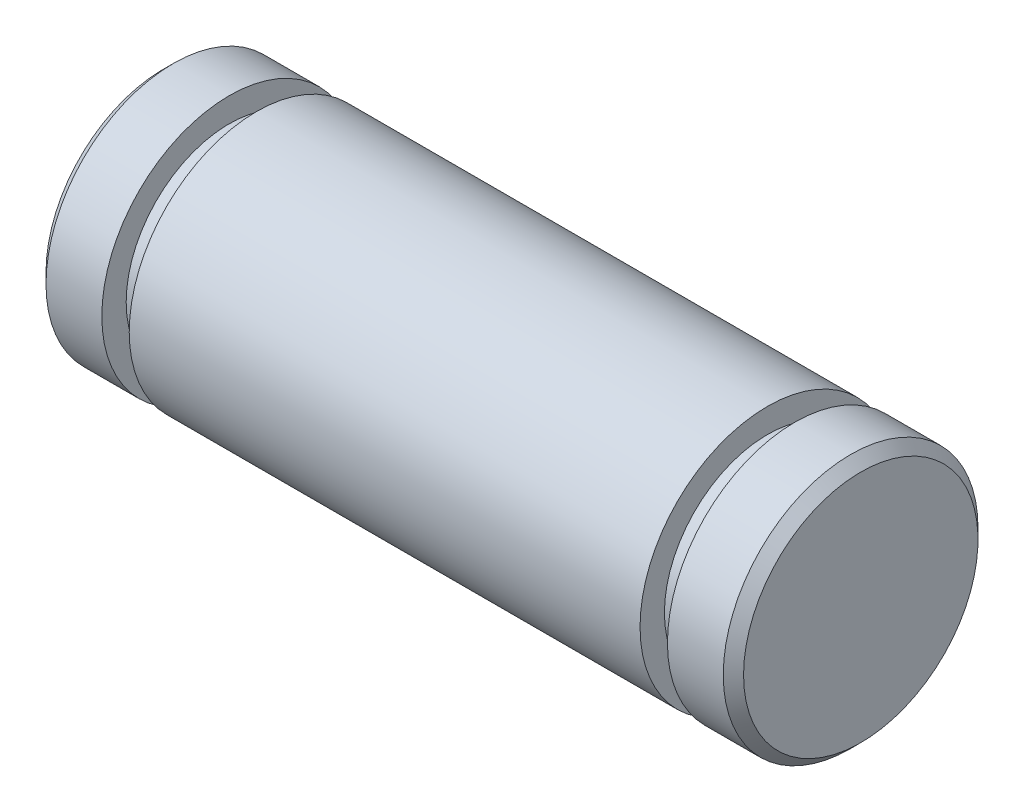
ISO-10303-21;
HEADER;
FILE_DESCRIPTION(('STEP AP214'),'2;1');
FILE_NAME('part.step','',(''),(''),'','','');
FILE_SCHEMA(('AUTOMOTIVE_DESIGN { 1 0 10303 214 1 1 1 1 }'));
ENDSEC;
DATA;
#1=APPLICATION_CONTEXT('core data for automotive mechanical design processes');
#2=APPLICATION_PROTOCOL_DEFINITION('international standard','automotive_design',2000,#1);
#3=PRODUCT_CONTEXT('',#1,'mechanical');
#4=PRODUCT('Part','Part','',(#3));
#5=PRODUCT_RELATED_PRODUCT_CATEGORY('part','',(#4));
#6=PRODUCT_DEFINITION_FORMATION('','',#4);
#7=PRODUCT_DEFINITION_CONTEXT('part definition',#1,'design');
#8=PRODUCT_DEFINITION('design','',#6,#7);
#9=PRODUCT_DEFINITION_SHAPE('','',#8);
#10=(LENGTH_UNIT() NAMED_UNIT(*) SI_UNIT(.MILLI.,.METRE.));
#11=(NAMED_UNIT(*) PLANE_ANGLE_UNIT() SI_UNIT($,.RADIAN.));
#12=(NAMED_UNIT(*) SI_UNIT($,.STERADIAN.) SOLID_ANGLE_UNIT());
#13=UNCERTAINTY_MEASURE_WITH_UNIT(LENGTH_MEASURE(1.E-05),#10,'distance_accuracy_value','');
#14=(GEOMETRIC_REPRESENTATION_CONTEXT(3) GLOBAL_UNCERTAINTY_ASSIGNED_CONTEXT((#13)) GLOBAL_UNIT_ASSIGNED_CONTEXT((#10,
#11,#12)) REPRESENTATION_CONTEXT('',''));
#15=CARTESIAN_POINT('',(0.,0.,0.));
#16=DIRECTION('',(0.,0.,1.));
#17=DIRECTION('',(1.,0.,0.));
#18=AXIS2_PLACEMENT_3D('',#15,#16,#17);
#19=CARTESIAN_POINT('',(-13.0937,0.,0.));
#20=DIRECTION('',(1.,0.,0.));
#21=DIRECTION('',(0.,0.,-1.));
#22=AXIS2_PLACEMENT_3D('',#19,#20,#21);
#23=PLANE('',#22);
#24=CARTESIAN_POINT('',(-13.0937,0.,0.));
#25=DIRECTION('',(-1.,0.,0.));
#26=DIRECTION('',(0.,0.,1.));
#27=AXIS2_PLACEMENT_3D('',#24,#25,#26);
#28=CIRCLE('',#27,4.40055);
#29=CARTESIAN_POINT('',(-13.0937,0.,4.40055));
#30=VERTEX_POINT('',#29);
#31=EDGE_CURVE('E10',#30,#30,#28,.T.);
#32=ORIENTED_EDGE('',*,*,#31,.T.);
#33=EDGE_LOOP('',(#32));
#34=FACE_BOUND('',#33,.T.);
#35=ADVANCED_FACE('F36',(#34),#23,.F.);
#36=CARTESIAN_POINT('',(-12.7127,0.,0.));
#37=DIRECTION('',(1.,0.,0.));
#38=DIRECTION('',(0.,0.,-1.));
#39=AXIS2_PLACEMENT_3D('',#36,#37,#38);
#40=CONICAL_SURFACE('',#39,4.78155,0.785398163397448);
#41=ORIENTED_EDGE('',*,*,#31,.F.);
#42=EDGE_LOOP('',(#41));
#43=FACE_BOUND('',#42,.T.);
#44=CARTESIAN_POINT('',(-12.7127,0.,0.));
#45=DIRECTION('',(-1.,0.,0.));
#46=DIRECTION('',(0.,0.,1.));
#47=AXIS2_PLACEMENT_3D('',#44,#45,#46);
#48=CIRCLE('',#47,4.78155);
#49=CARTESIAN_POINT('',(-12.7127,0.,4.78155));
#50=VERTEX_POINT('',#49);
#51=EDGE_CURVE('E42',#50,#50,#48,.T.);
#52=ORIENTED_EDGE('',*,*,#51,.T.);
#53=EDGE_LOOP('',(#52));
#54=FACE_BOUND('',#53,.T.);
#55=ADVANCED_FACE('F92',(#43,#54),#40,.T.);
#56=CARTESIAN_POINT('',(13.0937,0.,0.));
#57=DIRECTION('',(-1.,0.,0.));
#58=DIRECTION('',(0.,0.,1.));
#59=AXIS2_PLACEMENT_3D('',#56,#57,#58);
#60=CYLINDRICAL_SURFACE('',#59,4.78155);
#61=ORIENTED_EDGE('',*,*,#51,.F.);
#62=EDGE_LOOP('',(#61));
#63=FACE_BOUND('',#62,.T.);
#64=CARTESIAN_POINT('',(-10.6172,0.,0.));
#65=DIRECTION('',(-1.,0.,0.));
#66=DIRECTION('',(0.,0.,1.));
#67=AXIS2_PLACEMENT_3D('',#64,#65,#66);
#68=CIRCLE('',#67,4.78155);
#69=CARTESIAN_POINT('',(-10.6172,0.,4.78155));
#70=VERTEX_POINT('',#69);
#71=EDGE_CURVE('E46',#70,#70,#68,.T.);
#72=ORIENTED_EDGE('',*,*,#71,.T.);
#73=EDGE_LOOP('',(#72));
#74=FACE_BOUND('',#73,.T.);
#75=ADVANCED_FACE('F96',(#63,#74),#60,.T.);
#76=CARTESIAN_POINT('',(-10.6172,4.78155,0.));
#77=DIRECTION('',(-1.,0.,0.));
#78=DIRECTION('',(0.,0.,1.));
#79=AXIS2_PLACEMENT_3D('',#76,#77,#78);
#80=PLANE('',#79);
#81=ORIENTED_EDGE('',*,*,#71,.F.);
#82=EDGE_LOOP('',(#81));
#83=FACE_BOUND('',#82,.T.);
#84=CARTESIAN_POINT('',(-10.6172,0.,0.));
#85=DIRECTION('',(-1.,0.,0.));
#86=DIRECTION('',(0.,0.,1.));
#87=AXIS2_PLACEMENT_3D('',#84,#85,#86);
#88=CIRCLE('',#87,3.86715);
#89=CARTESIAN_POINT('',(-10.6172,0.,3.86715));
#90=VERTEX_POINT('',#89);
#91=EDGE_CURVE('E50',#90,#90,#88,.T.);
#92=ORIENTED_EDGE('',*,*,#91,.T.);
#93=EDGE_LOOP('',(#92));
#94=FACE_BOUND('',#93,.T.);
#95=ADVANCED_FACE('F101',(#83,#94),#80,.F.);
#96=CARTESIAN_POINT('',(13.0937,0.,0.));
#97=DIRECTION('',(-1.,0.,0.));
#98=DIRECTION('',(0.,0.,1.));
#99=AXIS2_PLACEMENT_3D('',#96,#97,#98);
#100=CYLINDRICAL_SURFACE('',#99,3.86715);
#101=ORIENTED_EDGE('',*,*,#91,.F.);
#102=EDGE_LOOP('',(#101));
#103=FACE_BOUND('',#102,.T.);
#104=CARTESIAN_POINT('',(-9.5885,0.,0.));
#105=DIRECTION('',(-1.,0.,0.));
#106=DIRECTION('',(0.,0.,1.));
#107=AXIS2_PLACEMENT_3D('',#104,#105,#106);
#108=CIRCLE('',#107,3.86715);
#109=CARTESIAN_POINT('',(-9.5885,0.,3.86715));
#110=VERTEX_POINT('',#109);
#111=EDGE_CURVE('E55',#110,#110,#108,.T.);
#112=ORIENTED_EDGE('',*,*,#111,.T.);
#113=EDGE_LOOP('',(#112));
#114=FACE_BOUND('',#113,.T.);
#115=ADVANCED_FACE('F107',(#103,#114),#100,.T.);
#116=CARTESIAN_POINT('',(-9.5885,3.86715,0.));
#117=DIRECTION('',(1.,0.,0.));
#118=DIRECTION('',(0.,0.,-1.));
#119=AXIS2_PLACEMENT_3D('',#116,#117,#118);
#120=PLANE('',#119);
#121=ORIENTED_EDGE('',*,*,#111,.F.);
#122=EDGE_LOOP('',(#121));
#123=FACE_BOUND('',#122,.T.);
#124=CARTESIAN_POINT('',(-9.5885,0.,0.));
#125=DIRECTION('',(-1.,0.,0.));
#126=DIRECTION('',(0.,0.,1.));
#127=AXIS2_PLACEMENT_3D('',#124,#125,#126);
#128=CIRCLE('',#127,4.78155);
#129=CARTESIAN_POINT('',(-9.5885,0.,4.78155));
#130=VERTEX_POINT('',#129);
#131=EDGE_CURVE('E58',#130,#130,#128,.T.);
#132=ORIENTED_EDGE('',*,*,#131,.T.);
#133=EDGE_LOOP('',(#132));
#134=FACE_BOUND('',#133,.T.);
#135=ADVANCED_FACE('F111',(#123,#134),#120,.F.);
#136=CARTESIAN_POINT('',(13.0937,0.,0.));
#137=DIRECTION('',(-1.,0.,0.));
#138=DIRECTION('',(0.,0.,1.));
#139=AXIS2_PLACEMENT_3D('',#136,#137,#138);
#140=CYLINDRICAL_SURFACE('',#139,4.78155);
#141=ORIENTED_EDGE('',*,*,#131,.F.);
#142=EDGE_LOOP('',(#141));
#143=FACE_BOUND('',#142,.T.);
#144=CARTESIAN_POINT('',(9.5885,0.,0.));
#145=DIRECTION('',(-1.,0.,0.));
#146=DIRECTION('',(0.,0.,1.));
#147=AXIS2_PLACEMENT_3D('',#144,#145,#146);
#148=CIRCLE('',#147,4.78155);
#149=CARTESIAN_POINT('',(9.5885,0.,4.78155));
#150=VERTEX_POINT('',#149);
#151=EDGE_CURVE('E61',#150,#150,#148,.T.);
#152=ORIENTED_EDGE('',*,*,#151,.T.);
#153=EDGE_LOOP('',(#152));
#154=FACE_BOUND('',#153,.T.);
#155=ADVANCED_FACE('F115',(#143,#154),#140,.T.);
#156=CARTESIAN_POINT('',(9.5885,4.78155,0.));
#157=DIRECTION('',(-1.,0.,0.));
#158=DIRECTION('',(0.,0.,1.));
#159=AXIS2_PLACEMENT_3D('',#156,#157,#158);
#160=PLANE('',#159);
#161=ORIENTED_EDGE('',*,*,#151,.F.);
#162=EDGE_LOOP('',(#161));
#163=FACE_BOUND('',#162,.T.);
#164=CARTESIAN_POINT('',(9.5885,0.,0.));
#165=DIRECTION('',(-1.,0.,0.));
#166=DIRECTION('',(0.,0.,1.));
#167=AXIS2_PLACEMENT_3D('',#164,#165,#166);
#168=CIRCLE('',#167,3.86715);
#169=CARTESIAN_POINT('',(9.5885,0.,3.86715));
#170=VERTEX_POINT('',#169);
#171=EDGE_CURVE('E64',#170,#170,#168,.T.);
#172=ORIENTED_EDGE('',*,*,#171,.T.);
#173=EDGE_LOOP('',(#172));
#174=FACE_BOUND('',#173,.T.);
#175=ADVANCED_FACE('F119',(#163,#174),#160,.F.);
#176=CARTESIAN_POINT('',(13.0937,0.,0.));
#177=DIRECTION('',(-1.,0.,0.));
#178=DIRECTION('',(0.,0.,1.));
#179=AXIS2_PLACEMENT_3D('',#176,#177,#178);
#180=CYLINDRICAL_SURFACE('',#179,3.86715);
#181=ORIENTED_EDGE('',*,*,#171,.F.);
#182=EDGE_LOOP('',(#181));
#183=FACE_BOUND('',#182,.T.);
#184=CARTESIAN_POINT('',(10.6172,0.,0.));
#185=DIRECTION('',(-1.,0.,0.));
#186=DIRECTION('',(0.,0.,1.));
#187=AXIS2_PLACEMENT_3D('',#184,#185,#186);
#188=CIRCLE('',#187,3.86715);
#189=CARTESIAN_POINT('',(10.6172,0.,3.86715));
#190=VERTEX_POINT('',#189);
#191=EDGE_CURVE('E67',#190,#190,#188,.T.);
#192=ORIENTED_EDGE('',*,*,#191,.T.);
#193=EDGE_LOOP('',(#192));
#194=FACE_BOUND('',#193,.T.);
#195=ADVANCED_FACE('F123',(#183,#194),#180,.T.);
#196=CARTESIAN_POINT('',(10.6172,3.86715,0.));
#197=DIRECTION('',(1.,0.,0.));
#198=DIRECTION('',(0.,0.,-1.));
#199=AXIS2_PLACEMENT_3D('',#196,#197,#198);
#200=PLANE('',#199);
#201=ORIENTED_EDGE('',*,*,#191,.F.);
#202=EDGE_LOOP('',(#201));
#203=FACE_BOUND('',#202,.T.);
#204=CARTESIAN_POINT('',(10.6172,0.,0.));
#205=DIRECTION('',(-1.,0.,0.));
#206=DIRECTION('',(0.,0.,1.));
#207=AXIS2_PLACEMENT_3D('',#204,#205,#206);
#208=CIRCLE('',#207,4.78155);
#209=CARTESIAN_POINT('',(10.6172,0.,4.78155));
#210=VERTEX_POINT('',#209);
#211=EDGE_CURVE('E70',#210,#210,#208,.T.);
#212=ORIENTED_EDGE('',*,*,#211,.T.);
#213=EDGE_LOOP('',(#212));
#214=FACE_BOUND('',#213,.T.);
#215=ADVANCED_FACE('F127',(#203,#214),#200,.F.);
#216=CARTESIAN_POINT('',(13.0937,0.,0.));
#217=DIRECTION('',(-1.,0.,0.));
#218=DIRECTION('',(0.,0.,1.));
#219=AXIS2_PLACEMENT_3D('',#216,#217,#218);
#220=CYLINDRICAL_SURFACE('',#219,4.78155);
#221=ORIENTED_EDGE('',*,*,#211,.F.);
#222=EDGE_LOOP('',(#221));
#223=FACE_BOUND('',#222,.T.);
#224=CARTESIAN_POINT('',(12.7127,0.,0.));
#225=DIRECTION('',(-1.,0.,0.));
#226=DIRECTION('',(0.,0.,1.));
#227=AXIS2_PLACEMENT_3D('',#224,#225,#226);
#228=CIRCLE('',#227,4.78155);
#229=CARTESIAN_POINT('',(12.7127,0.,4.78155));
#230=VERTEX_POINT('',#229);
#231=EDGE_CURVE('E73',#230,#230,#228,.T.);
#232=ORIENTED_EDGE('',*,*,#231,.T.);
#233=EDGE_LOOP('',(#232));
#234=FACE_BOUND('',#233,.T.);
#235=ADVANCED_FACE('F88',(#223,#234),#220,.T.);
#236=CARTESIAN_POINT('',(13.0937,0.,0.));
#237=DIRECTION('',(-1.,0.,0.));
#238=DIRECTION('',(0.,0.,1.));
#239=AXIS2_PLACEMENT_3D('',#236,#237,#238);
#240=CONICAL_SURFACE('',#239,4.40055,0.785398163397448);
#241=ORIENTED_EDGE('',*,*,#231,.F.);
#242=EDGE_LOOP('',(#241));
#243=FACE_BOUND('',#242,.T.);
#244=CARTESIAN_POINT('',(13.0937,0.,0.));
#245=DIRECTION('',(-1.,0.,0.));
#246=DIRECTION('',(0.,0.,1.));
#247=AXIS2_PLACEMENT_3D('',#244,#245,#246);
#248=CIRCLE('',#247,4.40055);
#249=CARTESIAN_POINT('',(13.0937,0.,4.40055));
#250=VERTEX_POINT('',#249);
#251=EDGE_CURVE('E76',#250,#250,#248,.T.);
#252=ORIENTED_EDGE('',*,*,#251,.T.);
#253=EDGE_LOOP('',(#252));
#254=FACE_BOUND('',#253,.T.);
#255=ADVANCED_FACE('F80',(#243,#254),#240,.T.);
#256=CARTESIAN_POINT('',(13.0937,4.40055,0.));
#257=DIRECTION('',(-1.,0.,0.));
#258=DIRECTION('',(0.,0.,1.));
#259=AXIS2_PLACEMENT_3D('',#256,#257,#258);
#260=PLANE('',#259);
#261=ORIENTED_EDGE('',*,*,#251,.F.);
#262=EDGE_LOOP('',(#261));
#263=FACE_BOUND('',#262,.T.);
#264=ADVANCED_FACE('F82',(#263),#260,.F.);
#265=CLOSED_SHELL('',(#35,#55,#75,#95,#115,#135,#155,#175,#195,#215,#235,#255,#264));
#266=MANIFOLD_SOLID_BREP('B2',#265);
#267=ADVANCED_BREP_SHAPE_REPRESENTATION('',(#18,#266),#14);
#268=SHAPE_DEFINITION_REPRESENTATION(#9,#267);
ENDSEC;
END-ISO-10303-21;
